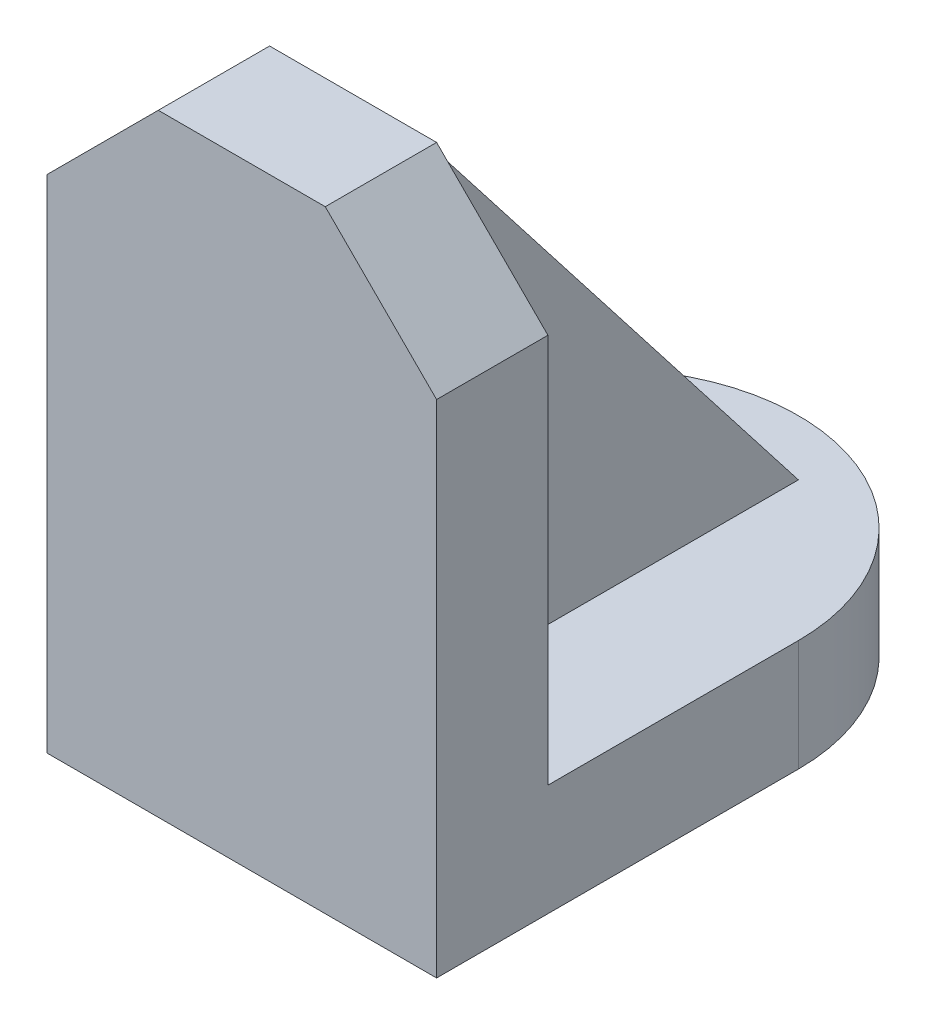
ISO-10303-21;
HEADER;
FILE_DESCRIPTION(('STEP AP214'),'2;1');
FILE_NAME('part.step','',(''),(''),'','','');
FILE_SCHEMA(('AUTOMOTIVE_DESIGN { 1 0 10303 214 1 1 1 1 }'));
ENDSEC;
DATA;
#1=APPLICATION_CONTEXT('core data for automotive mechanical design processes');
#2=APPLICATION_PROTOCOL_DEFINITION('international standard','automotive_design',2000,#1);
#3=PRODUCT_CONTEXT('',#1,'mechanical');
#4=PRODUCT('Part','Part','',(#3));
#5=PRODUCT_RELATED_PRODUCT_CATEGORY('part','',(#4));
#6=PRODUCT_DEFINITION_FORMATION('','',#4);
#7=PRODUCT_DEFINITION_CONTEXT('part definition',#1,'design');
#8=PRODUCT_DEFINITION('design','',#6,#7);
#9=PRODUCT_DEFINITION_SHAPE('','',#8);
#10=(LENGTH_UNIT() NAMED_UNIT(*) SI_UNIT(.MILLI.,.METRE.));
#11=(NAMED_UNIT(*) PLANE_ANGLE_UNIT() SI_UNIT($,.RADIAN.));
#12=(NAMED_UNIT(*) SI_UNIT($,.STERADIAN.) SOLID_ANGLE_UNIT());
#13=UNCERTAINTY_MEASURE_WITH_UNIT(LENGTH_MEASURE(1.E-05),#10,'distance_accuracy_value','');
#14=(GEOMETRIC_REPRESENTATION_CONTEXT(3) GLOBAL_UNCERTAINTY_ASSIGNED_CONTEXT((#13)) GLOBAL_UNIT_ASSIGNED_CONTEXT((#10,
#11,#12)) REPRESENTATION_CONTEXT('',''));
#15=CARTESIAN_POINT('',(0.,0.,0.));
#16=DIRECTION('',(0.,0.,1.));
#17=DIRECTION('',(1.,0.,0.));
#18=AXIS2_PLACEMENT_3D('',#15,#16,#17);
#19=CARTESIAN_POINT('',(-21.,66.,7.5));
#20=DIRECTION('',(0.,0.,-1.));
#21=DIRECTION('',(-1.,0.,0.));
#22=AXIS2_PLACEMENT_3D('',#19,#20,#21);
#23=PLANE('',#22);
#24=DIRECTION('',(1.,0.,0.));
#25=VECTOR('',#24,1.);
#26=CARTESIAN_POINT('',(-21.,66.,7.5));
#27=LINE('',#26,#25);
#28=CARTESIAN_POINT('',(-8.99999999999998,66.,7.5));
#29=VERTEX_POINT('',#28);
#30=CARTESIAN_POINT('',(-6.00000000000001,66.,7.5));
#31=VERTEX_POINT('',#30);
#32=EDGE_CURVE('E142',#29,#31,#27,.T.);
#33=ORIENTED_EDGE('',*,*,#32,.T.);
#34=DIRECTION('',(0.,1.,0.));
#35=VECTOR('',#34,1.);
#36=CARTESIAN_POINT('',(-6.00000000000001,66.,7.5));
#37=LINE('',#36,#35);
#38=CARTESIAN_POINT('',(-6.00000000000001,12.,7.5));
#39=VERTEX_POINT('',#38);
#40=EDGE_CURVE('E172',#39,#31,#37,.T.);
#41=ORIENTED_EDGE('',*,*,#40,.F.);
#42=DIRECTION('',(1.,0.,0.));
#43=VECTOR('',#42,1.);
#44=CARTESIAN_POINT('',(-21.,12.,7.5));
#45=LINE('',#44,#43);
#46=CARTESIAN_POINT('',(-21.,12.,7.5));
#47=VERTEX_POINT('',#46);
#48=EDGE_CURVE('E143',#47,#39,#45,.T.);
#49=ORIENTED_EDGE('',*,*,#48,.F.);
#50=DIRECTION('',(0.,-1.,0.));
#51=VECTOR('',#50,1.);
#52=CARTESIAN_POINT('',(-21.,66.,7.5));
#53=LINE('',#52,#51);
#54=CARTESIAN_POINT('',(-21.,54.,7.5));
#55=VERTEX_POINT('',#54);
#56=EDGE_CURVE('E188',#55,#47,#53,.T.);
#57=ORIENTED_EDGE('',*,*,#56,.F.);
#58=DIRECTION('',(0.707106781186549,0.707106781186546,0.));
#59=VECTOR('',#58,1.);
#60=CARTESIAN_POINT('',(-15.,60.,7.5));
#61=LINE('',#60,#59);
#62=EDGE_CURVE('E236',#55,#29,#61,.T.);
#63=ORIENTED_EDGE('',*,*,#62,.T.);
#64=EDGE_LOOP('',(#33,#41,#49,#57,#63));
#65=FACE_BOUND('',#64,.T.);
#66=ADVANCED_FACE('F47',(#65),#23,.T.);
#67=CARTESIAN_POINT('',(0.,12.,0.));
#68=DIRECTION('',(0.,1.,0.));
#69=DIRECTION('',(0.,0.,1.));
#70=AXIS2_PLACEMENT_3D('',#67,#68,#69);
#71=PLANE('',#70);
#72=DIRECTION('',(0.,0.,1.));
#73=VECTOR('',#72,1.);
#74=CARTESIAN_POINT('',(5.99999999999999,12.,7.5));
#75=LINE('',#74,#73);
#76=CARTESIAN_POINT('',(5.99999999999999,12.,-34.5));
#77=VERTEX_POINT('',#76);
#78=CARTESIAN_POINT('',(5.99999999999999,12.,7.5));
#79=VERTEX_POINT('',#78);
#80=EDGE_CURVE('E164',#77,#79,#75,.T.);
#81=ORIENTED_EDGE('',*,*,#80,.T.);
#82=CARTESIAN_POINT('',(21.,12.,7.5));
#83=VERTEX_POINT('',#82);
#84=EDGE_CURVE('E150',#79,#83,#45,.T.);
#85=ORIENTED_EDGE('',*,*,#84,.T.);
#86=DIRECTION('',(0.,0.,1.));
#87=VECTOR('',#86,1.);
#88=CARTESIAN_POINT('',(21.,12.,0.));
#89=LINE('',#88,#87);
#90=CARTESIAN_POINT('',(21.,12.,-19.5));
#91=VERTEX_POINT('',#90);
#92=EDGE_CURVE('E194',#91,#83,#89,.T.);
#93=ORIENTED_EDGE('',*,*,#92,.F.);
#94=CARTESIAN_POINT('',(0.,12.,-19.5));
#95=DIRECTION('',(0.,1.,0.));
#96=DIRECTION('',(0.,0.,1.));
#97=AXIS2_PLACEMENT_3D('',#94,#95,#96);
#98=CIRCLE('',#97,21.);
#99=CARTESIAN_POINT('',(-21.,12.,-19.5));
#100=VERTEX_POINT('',#99);
#101=EDGE_CURVE('E198',#91,#100,#98,.T.);
#102=ORIENTED_EDGE('',*,*,#101,.T.);
#103=DIRECTION('',(0.,0.,1.));
#104=VECTOR('',#103,1.);
#105=CARTESIAN_POINT('',(-21.,12.,0.));
#106=LINE('',#105,#104);
#107=EDGE_CURVE('E202',#100,#47,#106,.T.);
#108=ORIENTED_EDGE('',*,*,#107,.T.);
#109=ORIENTED_EDGE('',*,*,#48,.T.);
#110=DIRECTION('',(0.,0.,1.));
#111=VECTOR('',#110,1.);
#112=CARTESIAN_POINT('',(-6.00000000000001,12.,7.5));
#113=LINE('',#112,#111);
#114=CARTESIAN_POINT('',(-6.00000000000001,12.,-34.5));
#115=VERTEX_POINT('',#114);
#116=EDGE_CURVE('E69',#115,#39,#113,.T.);
#117=ORIENTED_EDGE('',*,*,#116,.F.);
#118=DIRECTION('',(-1.,0.,0.));
#119=VECTOR('',#118,1.);
#120=CARTESIAN_POINT('',(5.99999999999999,12.,-34.5));
#121=LINE('',#120,#119);
#122=EDGE_CURVE('E64',#77,#115,#121,.T.);
#123=ORIENTED_EDGE('',*,*,#122,.F.);
#124=EDGE_LOOP('',(#81,#85,#93,#102,#108,#109,#117,#123));
#125=FACE_BOUND('',#124,.T.);
#126=ADVANCED_FACE('F264',(#125),#71,.T.);
#127=CARTESIAN_POINT('',(21.,12.,0.));
#128=DIRECTION('',(1.,0.,0.));
#129=DIRECTION('',(0.,0.,-1.));
#130=AXIS2_PLACEMENT_3D('',#127,#128,#129);
#131=PLANE('',#130);
#132=DIRECTION('',(0.,-1.,0.));
#133=VECTOR('',#132,1.);
#134=CARTESIAN_POINT('',(21.,66.,7.5));
#135=LINE('',#134,#133);
#136=CARTESIAN_POINT('',(21.,53.9999999999999,7.5));
#137=VERTEX_POINT('',#136);
#138=EDGE_CURVE('E185',#137,#83,#135,.T.);
#139=ORIENTED_EDGE('',*,*,#138,.F.);
#140=DIRECTION('',(0.,0.,1.));
#141=VECTOR('',#140,1.);
#142=CARTESIAN_POINT('',(21.,53.9999999999999,0.));
#143=LINE('',#142,#141);
#144=CARTESIAN_POINT('',(21.,53.9999999999999,19.5));
#145=VERTEX_POINT('',#144);
#146=EDGE_CURVE('E57',#137,#145,#143,.T.);
#147=ORIENTED_EDGE('',*,*,#146,.T.);
#148=DIRECTION('',(0.,-1.,0.));
#149=VECTOR('',#148,1.);
#150=CARTESIAN_POINT('',(21.,12.,19.5));
#151=LINE('',#150,#149);
#152=CARTESIAN_POINT('',(21.,0.,19.5));
#153=VERTEX_POINT('',#152);
#154=EDGE_CURVE('E206',#145,#153,#151,.T.);
#155=ORIENTED_EDGE('',*,*,#154,.T.);
#156=DIRECTION('',(0.,0.,1.));
#157=VECTOR('',#156,1.);
#158=CARTESIAN_POINT('',(21.,0.,0.));
#159=LINE('',#158,#157);
#160=CARTESIAN_POINT('',(21.,0.,-19.5));
#161=VERTEX_POINT('',#160);
#162=EDGE_CURVE('E191',#161,#153,#159,.T.);
#163=ORIENTED_EDGE('',*,*,#162,.F.);
#164=DIRECTION('',(0.,-1.,0.));
#165=VECTOR('',#164,1.);
#166=CARTESIAN_POINT('',(21.,12.,-19.5));
#167=LINE('',#166,#165);
#168=EDGE_CURVE('E229',#91,#161,#167,.T.);
#169=ORIENTED_EDGE('',*,*,#168,.F.);
#170=ORIENTED_EDGE('',*,*,#92,.T.);
#171=EDGE_LOOP('',(#139,#147,#155,#163,#169,#170));
#172=FACE_BOUND('',#171,.T.);
#173=ADVANCED_FACE('F254',(#172),#131,.T.);
#174=CARTESIAN_POINT('',(0.,12.,-19.5));
#175=DIRECTION('',(0.,-1.,0.));
#176=DIRECTION('',(0.,0.,-1.));
#177=AXIS2_PLACEMENT_3D('',#174,#175,#176);
#178=CYLINDRICAL_SURFACE('',#177,21.);
#179=CARTESIAN_POINT('',(0.,0.,-19.5));
#180=DIRECTION('',(0.,1.,0.));
#181=DIRECTION('',(0.,0.,1.));
#182=AXIS2_PLACEMENT_3D('',#179,#180,#181);
#183=CIRCLE('',#182,21.);
#184=CARTESIAN_POINT('',(-21.,0.,-19.5));
#185=VERTEX_POINT('',#184);
#186=EDGE_CURVE('E210',#161,#185,#183,.T.);
#187=ORIENTED_EDGE('',*,*,#186,.T.);
#188=DIRECTION('',(0.,-1.,0.));
#189=VECTOR('',#188,1.);
#190=CARTESIAN_POINT('',(-21.,12.,-19.5));
#191=LINE('',#190,#189);
#192=EDGE_CURVE('E225',#100,#185,#191,.T.);
#193=ORIENTED_EDGE('',*,*,#192,.F.);
#194=ORIENTED_EDGE('',*,*,#101,.F.);
#195=ORIENTED_EDGE('',*,*,#168,.T.);
#196=EDGE_LOOP('',(#187,#193,#194,#195));
#197=FACE_BOUND('',#196,.T.);
#198=ADVANCED_FACE('F269',(#197),#178,.T.);
#199=CARTESIAN_POINT('',(-21.,12.,0.));
#200=DIRECTION('',(1.,0.,0.));
#201=DIRECTION('',(0.,0.,-1.));
#202=AXIS2_PLACEMENT_3D('',#199,#200,#201);
#203=PLANE('',#202);
#204=DIRECTION('',(0.,-1.,0.));
#205=VECTOR('',#204,1.);
#206=CARTESIAN_POINT('',(-21.,12.,19.5));
#207=LINE('',#206,#205);
#208=CARTESIAN_POINT('',(-21.,54.,19.5));
#209=VERTEX_POINT('',#208);
#210=CARTESIAN_POINT('',(-21.,0.,19.5));
#211=VERTEX_POINT('',#210);
#212=EDGE_CURVE('E222',#209,#211,#207,.T.);
#213=ORIENTED_EDGE('',*,*,#212,.F.);
#214=DIRECTION('',(0.,0.,-1.));
#215=VECTOR('',#214,1.);
#216=CARTESIAN_POINT('',(-21.,54.,7.5));
#217=LINE('',#216,#215);
#218=EDGE_CURVE('E232',#209,#55,#217,.T.);
#219=ORIENTED_EDGE('',*,*,#218,.T.);
#220=ORIENTED_EDGE('',*,*,#56,.T.);
#221=ORIENTED_EDGE('',*,*,#107,.F.);
#222=ORIENTED_EDGE('',*,*,#192,.T.);
#223=DIRECTION('',(0.,0.,1.));
#224=VECTOR('',#223,1.);
#225=CARTESIAN_POINT('',(-21.,0.,0.));
#226=LINE('',#225,#224);
#227=EDGE_CURVE('E213',#185,#211,#226,.T.);
#228=ORIENTED_EDGE('',*,*,#227,.T.);
#229=EDGE_LOOP('',(#213,#219,#220,#221,#222,#228));
#230=FACE_BOUND('',#229,.T.);
#231=ADVANCED_FACE('F274',(#230),#203,.F.);
#232=CARTESIAN_POINT('',(0.,12.,19.5));
#233=DIRECTION('',(0.,0.,-1.));
#234=DIRECTION('',(-1.,0.,0.));
#235=AXIS2_PLACEMENT_3D('',#232,#233,#234);
#236=PLANE('',#235);
#237=ORIENTED_EDGE('',*,*,#154,.F.);
#238=DIRECTION('',(0.707106781186546,-0.707106781186549,0.));
#239=VECTOR('',#238,1.);
#240=CARTESIAN_POINT('',(9.,66.,19.5));
#241=LINE('',#240,#239);
#242=CARTESIAN_POINT('',(9.00000000000001,66.,19.5));
#243=VERTEX_POINT('',#242);
#244=EDGE_CURVE('E11',#145,#243,#241,.F.);
#245=ORIENTED_EDGE('',*,*,#244,.T.);
#246=DIRECTION('',(1.,0.,0.));
#247=VECTOR('',#246,1.);
#248=CARTESIAN_POINT('',(-21.,66.,19.5));
#249=LINE('',#248,#247);
#250=CARTESIAN_POINT('',(-8.99999999999998,66.,19.5));
#251=VERTEX_POINT('',#250);
#252=EDGE_CURVE('E182',#251,#243,#249,.T.);
#253=ORIENTED_EDGE('',*,*,#252,.F.);
#254=DIRECTION('',(-0.707106781186549,-0.707106781186546,0.));
#255=VECTOR('',#254,1.);
#256=CARTESIAN_POINT('',(-21.,54.,19.5));
#257=LINE('',#256,#255);
#258=EDGE_CURVE('E242',#251,#209,#257,.T.);
#259=ORIENTED_EDGE('',*,*,#258,.T.);
#260=ORIENTED_EDGE('',*,*,#212,.T.);
#261=DIRECTION('',(1.,0.,0.));
#262=VECTOR('',#261,1.);
#263=CARTESIAN_POINT('',(0.,0.,19.5));
#264=LINE('',#263,#262);
#265=EDGE_CURVE('E199',#211,#153,#264,.T.);
#266=ORIENTED_EDGE('',*,*,#265,.T.);
#267=EDGE_LOOP('',(#237,#245,#253,#259,#260,#266));
#268=FACE_BOUND('',#267,.T.);
#269=ADVANCED_FACE('F259',(#268),#236,.F.);
#270=CARTESIAN_POINT('',(0.,0.,0.));
#271=DIRECTION('',(0.,1.,0.));
#272=DIRECTION('',(0.,0.,1.));
#273=AXIS2_PLACEMENT_3D('',#270,#271,#272);
#274=PLANE('',#273);
#275=ORIENTED_EDGE('',*,*,#162,.T.);
#276=ORIENTED_EDGE('',*,*,#265,.F.);
#277=ORIENTED_EDGE('',*,*,#227,.F.);
#278=ORIENTED_EDGE('',*,*,#186,.F.);
#279=EDGE_LOOP('',(#275,#276,#277,#278));
#280=FACE_BOUND('',#279,.T.);
#281=ADVANCED_FACE('F296',(#280),#274,.F.);
#282=DIRECTION('',(0.,1.,0.));
#283=VECTOR('',#282,1.);
#284=CARTESIAN_POINT('',(5.99999999999999,66.,7.5));
#285=LINE('',#284,#283);
#286=CARTESIAN_POINT('',(5.99999999999999,66.,7.5));
#287=VERTEX_POINT('',#286);
#288=EDGE_CURVE('E147',#79,#287,#285,.T.);
#289=ORIENTED_EDGE('',*,*,#288,.T.);
#290=CARTESIAN_POINT('',(9.00000000000001,66.,7.5));
#291=VERTEX_POINT('',#290);
#292=EDGE_CURVE('E129',#287,#291,#27,.T.);
#293=ORIENTED_EDGE('',*,*,#292,.T.);
#294=DIRECTION('',(-0.707106781186546,0.707106781186549,0.));
#295=VECTOR('',#294,1.);
#296=CARTESIAN_POINT('',(-5.99999999999994,81.,7.5));
#297=LINE('',#296,#295);
#298=EDGE_CURVE('E247',#291,#137,#297,.F.);
#299=ORIENTED_EDGE('',*,*,#298,.T.);
#300=ORIENTED_EDGE('',*,*,#138,.T.);
#301=ORIENTED_EDGE('',*,*,#84,.F.);
#302=EDGE_LOOP('',(#289,#293,#299,#300,#301));
#303=FACE_BOUND('',#302,.T.);
#304=ADVANCED_FACE('F148',(#303),#23,.T.);
#305=CARTESIAN_POINT('',(0.,66.,0.));
#306=DIRECTION('',(0.,1.,0.));
#307=DIRECTION('',(0.,0.,1.));
#308=AXIS2_PLACEMENT_3D('',#305,#306,#307);
#309=PLANE('',#308);
#310=ORIENTED_EDGE('',*,*,#252,.T.);
#311=DIRECTION('',(0.,0.,-1.));
#312=VECTOR('',#311,1.);
#313=CARTESIAN_POINT('',(9.,66.,0.));
#314=LINE('',#313,#312);
#315=EDGE_CURVE('E138',#243,#291,#314,.T.);
#316=ORIENTED_EDGE('',*,*,#315,.T.);
#317=ORIENTED_EDGE('',*,*,#292,.F.);
#318=DIRECTION('',(-1.,0.,0.));
#319=VECTOR('',#318,1.);
#320=CARTESIAN_POINT('',(5.99999999999999,66.,7.5));
#321=LINE('',#320,#319);
#322=EDGE_CURVE('E135',#287,#31,#321,.T.);
#323=ORIENTED_EDGE('',*,*,#322,.T.);
#324=ORIENTED_EDGE('',*,*,#32,.F.);
#325=DIRECTION('',(0.,0.,1.));
#326=VECTOR('',#325,1.);
#327=CARTESIAN_POINT('',(-8.99999999999998,66.,19.5));
#328=LINE('',#327,#326);
#329=EDGE_CURVE('E239',#29,#251,#328,.T.);
#330=ORIENTED_EDGE('',*,*,#329,.T.);
#331=EDGE_LOOP('',(#310,#316,#317,#323,#324,#330));
#332=FACE_BOUND('',#331,.T.);
#333=ADVANCED_FACE('F132',(#332),#309,.T.);
#334=CARTESIAN_POINT('',(-21.,54.,0.));
#335=DIRECTION('',(-0.707106781186546,0.707106781186549,0.));
#336=DIRECTION('',(0.,0.,1.));
#337=AXIS2_PLACEMENT_3D('',#334,#335,#336);
#338=PLANE('',#337);
#339=ORIENTED_EDGE('',*,*,#258,.F.);
#340=ORIENTED_EDGE('',*,*,#329,.F.);
#341=ORIENTED_EDGE('',*,*,#62,.F.);
#342=ORIENTED_EDGE('',*,*,#218,.F.);
#343=EDGE_LOOP('',(#339,#340,#341,#342));
#344=FACE_BOUND('',#343,.T.);
#345=ADVANCED_FACE('F301',(#344),#338,.T.);
#346=CARTESIAN_POINT('',(9.,66.,0.));
#347=DIRECTION('',(-0.707106781186549,-0.707106781186546,0.));
#348=DIRECTION('',(0.,0.,-1.));
#349=AXIS2_PLACEMENT_3D('',#346,#347,#348);
#350=PLANE('',#349);
#351=ORIENTED_EDGE('',*,*,#244,.F.);
#352=ORIENTED_EDGE('',*,*,#146,.F.);
#353=ORIENTED_EDGE('',*,*,#298,.F.);
#354=ORIENTED_EDGE('',*,*,#315,.F.);
#355=EDGE_LOOP('',(#351,#352,#353,#354));
#356=FACE_BOUND('',#355,.T.);
#357=ADVANCED_FACE('F50',(#356),#350,.F.);
#358=CARTESIAN_POINT('',(5.99999999999999,12.,-34.5));
#359=DIRECTION('',(0.,0.61394061351492,-0.789352217376326));
#360=DIRECTION('',(0.,0.789352217376326,0.61394061351492));
#361=AXIS2_PLACEMENT_3D('',#358,#359,#360);
#362=PLANE('',#361);
#363=DIRECTION('',(0.,-0.789352217376326,-0.61394061351492));
#364=VECTOR('',#363,1.);
#365=CARTESIAN_POINT('',(-6.00000000000001,12.,-34.5));
#366=LINE('',#365,#364);
#367=EDGE_CURVE('E161',#31,#115,#366,.T.);
#368=ORIENTED_EDGE('',*,*,#367,.F.);
#369=ORIENTED_EDGE('',*,*,#322,.F.);
#370=DIRECTION('',(0.,-0.789352217376326,-0.61394061351492));
#371=VECTOR('',#370,1.);
#372=CARTESIAN_POINT('',(5.99999999999999,12.,-34.5));
#373=LINE('',#372,#371);
#374=EDGE_CURVE('E155',#287,#77,#373,.T.);
#375=ORIENTED_EDGE('',*,*,#374,.T.);
#376=ORIENTED_EDGE('',*,*,#122,.T.);
#377=EDGE_LOOP('',(#368,#369,#375,#376));
#378=FACE_BOUND('',#377,.T.);
#379=ADVANCED_FACE('F159',(#378),#362,.T.);
#380=CARTESIAN_POINT('',(5.99999999999999,0.,0.));
#381=DIRECTION('',(1.,0.,0.));
#382=DIRECTION('',(0.,0.,-1.));
#383=AXIS2_PLACEMENT_3D('',#380,#381,#382);
#384=PLANE('',#383);
#385=ORIENTED_EDGE('',*,*,#288,.F.);
#386=ORIENTED_EDGE('',*,*,#80,.F.);
#387=ORIENTED_EDGE('',*,*,#374,.F.);
#388=EDGE_LOOP('',(#385,#386,#387));
#389=FACE_BOUND('',#388,.T.);
#390=ADVANCED_FACE('F166',(#389),#384,.T.);
#391=CARTESIAN_POINT('',(-6.00000000000001,0.,0.));
#392=DIRECTION('',(1.,0.,0.));
#393=DIRECTION('',(0.,0.,-1.));
#394=AXIS2_PLACEMENT_3D('',#391,#392,#393);
#395=PLANE('',#394);
#396=ORIENTED_EDGE('',*,*,#40,.T.);
#397=ORIENTED_EDGE('',*,*,#367,.T.);
#398=ORIENTED_EDGE('',*,*,#116,.T.);
#399=EDGE_LOOP('',(#396,#397,#398));
#400=FACE_BOUND('',#399,.T.);
#401=ADVANCED_FACE('F280',(#400),#395,.F.);
#402=CLOSED_SHELL('',(#66,#126,#173,#198,#231,#269,#281,#304,#333,#345,#357,#379,#390,#401));
#403=MANIFOLD_SOLID_BREP('B2',#402);
#404=ADVANCED_BREP_SHAPE_REPRESENTATION('',(#18,#403),#14);
#405=SHAPE_DEFINITION_REPRESENTATION(#9,#404);
ENDSEC;
END-ISO-10303-21;
